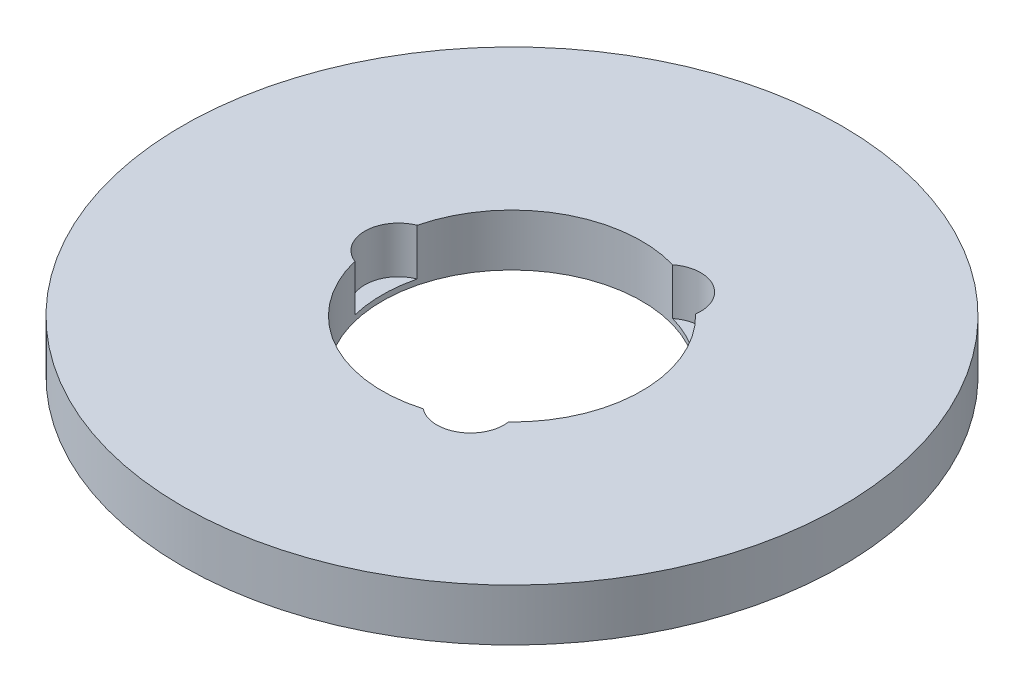
ISO-10303-21;
HEADER;
FILE_DESCRIPTION(('STEP AP214'),'2;1');
FILE_NAME('part.step','',(''),(''),'','','');
FILE_SCHEMA(('AUTOMOTIVE_DESIGN { 1 0 10303 214 1 1 1 1 }'));
ENDSEC;
DATA;
#1=APPLICATION_CONTEXT('core data for automotive mechanical design processes');
#2=APPLICATION_PROTOCOL_DEFINITION('international standard','automotive_design',2000,#1);
#3=PRODUCT_CONTEXT('',#1,'mechanical');
#4=PRODUCT('Part','Part','',(#3));
#5=PRODUCT_RELATED_PRODUCT_CATEGORY('part','',(#4));
#6=PRODUCT_DEFINITION_FORMATION('','',#4);
#7=PRODUCT_DEFINITION_CONTEXT('part definition',#1,'design');
#8=PRODUCT_DEFINITION('design','',#6,#7);
#9=PRODUCT_DEFINITION_SHAPE('','',#8);
#10=(LENGTH_UNIT() NAMED_UNIT(*) SI_UNIT(.MILLI.,.METRE.));
#11=(NAMED_UNIT(*) PLANE_ANGLE_UNIT() SI_UNIT($,.RADIAN.));
#12=(NAMED_UNIT(*) SI_UNIT($,.STERADIAN.) SOLID_ANGLE_UNIT());
#13=UNCERTAINTY_MEASURE_WITH_UNIT(LENGTH_MEASURE(1.E-05),#10,'distance_accuracy_value','');
#14=(GEOMETRIC_REPRESENTATION_CONTEXT(3) GLOBAL_UNCERTAINTY_ASSIGNED_CONTEXT((#13)) GLOBAL_UNIT_ASSIGNED_CONTEXT((#10,
#11,#12)) REPRESENTATION_CONTEXT('',''));
#15=CARTESIAN_POINT('',(0.,0.,0.));
#16=DIRECTION('',(0.,0.,1.));
#17=DIRECTION('',(1.,0.,0.));
#18=AXIS2_PLACEMENT_3D('',#15,#16,#17);
#19=CARTESIAN_POINT('',(0.,13.,0.));
#20=DIRECTION('',(0.,-1.,0.));
#21=DIRECTION('',(0.,0.,-1.));
#22=AXIS2_PLACEMENT_3D('',#19,#20,#21);
#23=CYLINDRICAL_SURFACE('',#22,82.5);
#24=CARTESIAN_POINT('',(0.,13.,0.));
#25=DIRECTION('',(0.,1.,0.));
#26=DIRECTION('',(0.,0.,1.));
#27=AXIS2_PLACEMENT_3D('',#24,#25,#26);
#28=CIRCLE('',#27,82.5);
#29=CARTESIAN_POINT('',(0.,13.,-82.5));
#30=VERTEX_POINT('',#29);
#31=EDGE_CURVE('E130',#30,#30,#28,.T.);
#32=CARTESIAN_POINT('',(0.,0.,0.));
#33=DIRECTION('',(0.,1.,0.));
#34=DIRECTION('',(0.,0.,1.));
#35=AXIS2_PLACEMENT_3D('',#32,#33,#34);
#36=CIRCLE('',#35,82.5);
#37=CARTESIAN_POINT('',(0.,0.,-82.5));
#38=VERTEX_POINT('',#37);
#39=EDGE_CURVE('E117',#38,#38,#36,.T.);
#40=CARTESIAN_POINT('',(0.,13.,-82.5));
#41=CARTESIAN_POINT('',(0.,12.8645833333333,-82.5));
#42=CARTESIAN_POINT('',(0.,12.7291666666667,-82.5));
#43=CARTESIAN_POINT('',(0.,12.4583333333333,-82.5));
#44=CARTESIAN_POINT('',(0.,12.3229166666667,-82.5));
#45=CARTESIAN_POINT('',(0.,12.0520833333333,-82.5));
#46=CARTESIAN_POINT('',(0.,11.9166666666667,-82.5));
#47=CARTESIAN_POINT('',(0.,11.6458333333333,-82.5));
#48=CARTESIAN_POINT('',(0.,11.5104166666667,-82.5));
#49=CARTESIAN_POINT('',(0.,11.2395833333333,-82.5));
#50=CARTESIAN_POINT('',(0.,11.1041666666667,-82.5));
#51=CARTESIAN_POINT('',(0.,10.8333333333333,-82.5));
#52=CARTESIAN_POINT('',(0.,10.6979166666667,-82.5));
#53=CARTESIAN_POINT('',(0.,10.4270833333333,-82.5));
#54=CARTESIAN_POINT('',(0.,10.2916666666667,-82.5));
#55=CARTESIAN_POINT('',(0.,10.0208333333333,-82.5));
#56=CARTESIAN_POINT('',(0.,9.88541666666667,-82.5));
#57=CARTESIAN_POINT('',(0.,9.61458333333333,-82.5));
#58=CARTESIAN_POINT('',(0.,9.47916666666667,-82.5));
#59=CARTESIAN_POINT('',(0.,9.20833333333333,-82.5));
#60=CARTESIAN_POINT('',(0.,9.07291666666667,-82.5));
#61=CARTESIAN_POINT('',(0.,8.80208333333333,-82.5));
#62=CARTESIAN_POINT('',(0.,8.66666666666667,-82.5));
#63=CARTESIAN_POINT('',(0.,8.39583333333333,-82.5));
#64=CARTESIAN_POINT('',(0.,8.26041666666667,-82.5));
#65=CARTESIAN_POINT('',(0.,7.98958333333333,-82.5));
#66=CARTESIAN_POINT('',(0.,7.85416666666667,-82.5));
#67=CARTESIAN_POINT('',(0.,7.58333333333333,-82.5));
#68=CARTESIAN_POINT('',(0.,7.44791666666667,-82.5));
#69=CARTESIAN_POINT('',(0.,7.17708333333333,-82.5));
#70=CARTESIAN_POINT('',(0.,7.04166666666667,-82.5));
#71=CARTESIAN_POINT('',(0.,6.77083333333333,-82.5));
#72=CARTESIAN_POINT('',(0.,6.63541666666667,-82.5));
#73=CARTESIAN_POINT('',(0.,6.36458333333333,-82.5));
#74=CARTESIAN_POINT('',(0.,6.22916666666667,-82.5));
#75=CARTESIAN_POINT('',(0.,5.95833333333333,-82.5));
#76=CARTESIAN_POINT('',(0.,5.82291666666667,-82.5));
#77=CARTESIAN_POINT('',(0.,5.55208333333333,-82.5));
#78=CARTESIAN_POINT('',(0.,5.41666666666667,-82.5));
#79=CARTESIAN_POINT('',(0.,5.14583333333333,-82.5));
#80=CARTESIAN_POINT('',(0.,5.01041666666667,-82.5));
#81=CARTESIAN_POINT('',(0.,4.73958333333333,-82.5));
#82=CARTESIAN_POINT('',(0.,4.60416666666667,-82.5));
#83=CARTESIAN_POINT('',(0.,4.33333333333333,-82.5));
#84=CARTESIAN_POINT('',(0.,4.19791666666667,-82.5));
#85=CARTESIAN_POINT('',(0.,3.92708333333333,-82.5));
#86=CARTESIAN_POINT('',(0.,3.79166666666667,-82.5));
#87=CARTESIAN_POINT('',(0.,3.52083333333333,-82.5));
#88=CARTESIAN_POINT('',(0.,3.38541666666667,-82.5));
#89=CARTESIAN_POINT('',(0.,3.11458333333333,-82.5));
#90=CARTESIAN_POINT('',(0.,2.97916666666667,-82.5));
#91=CARTESIAN_POINT('',(0.,2.70833333333333,-82.5));
#92=CARTESIAN_POINT('',(0.,2.57291666666667,-82.5));
#93=CARTESIAN_POINT('',(0.,2.30208333333333,-82.5));
#94=CARTESIAN_POINT('',(0.,2.16666666666667,-82.5));
#95=CARTESIAN_POINT('',(0.,1.89583333333333,-82.5));
#96=CARTESIAN_POINT('',(0.,1.76041666666667,-82.5));
#97=CARTESIAN_POINT('',(0.,1.48958333333333,-82.5));
#98=CARTESIAN_POINT('',(0.,1.35416666666667,-82.5));
#99=CARTESIAN_POINT('',(0.,1.08333333333333,-82.5));
#100=CARTESIAN_POINT('',(0.,0.947916666666667,-82.5));
#101=CARTESIAN_POINT('',(0.,0.677083333333334,-82.5));
#102=CARTESIAN_POINT('',(0.,0.541666666666667,-82.5));
#103=CARTESIAN_POINT('',(0.,0.270833333333334,-82.5));
#104=CARTESIAN_POINT('',(0.,0.135416666666667,-82.5));
#105=CARTESIAN_POINT('',(0.,0.,-82.5));
#106=B_SPLINE_CURVE_WITH_KNOTS('',3,(#40,#41,#42,#43,#44,#45,#46,#47,#48,#49,#50,#51,#52,#53,
#54,#55,#56,#57,#58,#59,#60,#61,#62,#63,#64,#65,#66,#67,#68,#69,#70,#71,#72,#73,#74,#75,#76,#77,
#78,#79,#80,#81,#82,#83,#84,#85,#86,#87,#88,#89,#90,#91,#92,#93,#94,#95,#96,#97,#98,#99,#100,
#101,#102,#103,#104,#105),.UNSPECIFIED.,.F.,.F.,(4,2,2,2,2,2,2,2,2,2,2,2,2,2,2,2,2,2,2,2,2,2,2,
2,2,2,2,2,2,2,2,2,4),(0.,0.406249999999999,0.812499999999999,1.21875,1.625,2.03125,2.4375,
2.84375,3.25,3.65625,4.0625,4.46875,4.875,5.28125,5.6875,6.09375,6.5,6.90625,7.3125,7.71875,
8.125,8.53125,8.9375,9.34375,9.75,10.15625,10.5625,10.96875,11.375,11.78125,12.1875,12.59375,
13.),.UNSPECIFIED.);
#107=EDGE_CURVE('BSEAM39',#30,#38,#106,.T.);
#108=ORIENTED_EDGE('',*,*,#31,.F.);
#109=ORIENTED_EDGE('',*,*,#39,.T.);
#110=ORIENTED_EDGE('',*,*,#107,.T.);
#111=ORIENTED_EDGE('',*,*,#107,.F.);
#112=EDGE_LOOP('',(#108,#110,#109,#111));
#113=FACE_BOUND('',#112,.T.);
#114=ADVANCED_FACE('F39',(#113),#23,.T.);
#115=CARTESIAN_POINT('',(0.,13.,0.));
#116=DIRECTION('',(0.,1.,0.));
#117=DIRECTION('',(0.,0.,1.));
#118=AXIS2_PLACEMENT_3D('',#115,#116,#117);
#119=PLANE('',#118);
#120=CARTESIAN_POINT('',(14.2132326895072,13.,24.618041158025));
#121=DIRECTION('',(0.,1.,0.));
#122=DIRECTION('',(0.866025403784436,0.,-0.500000000000004));
#123=AXIS2_PLACEMENT_3D('',#120,#121,#122);
#124=CIRCLE('',#123,8.4118358545254);
#125=CARTESIAN_POINT('',(9.0086788623039,13.,31.226490439303));
#126=VERTEX_POINT('',#125);
#127=CARTESIAN_POINT('',(22.5385945603165,13.,23.4149899689423));
#128=VERTEX_POINT('',#127);
#129=EDGE_CURVE('E148',#126,#128,#124,.T.);
#130=ORIENTED_EDGE('',*,*,#129,.F.);
#131=CARTESIAN_POINT('',(0.,13.,0.));
#132=DIRECTION('',(0.,1.,0.));
#133=DIRECTION('',(0.,0.,1.));
#134=AXIS2_PLACEMENT_3D('',#131,#132,#133);
#135=CIRCLE('',#134,32.5);
#136=CARTESIAN_POINT('',(-31.5472734226202,13.,7.81150047036054));
#137=VERTEX_POINT('',#136);
#138=EDGE_CURVE('E113',#137,#126,#135,.T.);
#139=ORIENTED_EDGE('',*,*,#138,.F.);
#140=CARTESIAN_POINT('',(-28.4264653790142,13.,0.));
#141=DIRECTION('',(0.,1.,0.));
#142=DIRECTION('',(0.,0.,1.));
#143=AXIS2_PLACEMENT_3D('',#140,#141,#142);
#144=CIRCLE('',#143,8.4118358545254);
#145=CARTESIAN_POINT('',(-31.5472734226202,13.,-7.81150047036054));
#146=VERTEX_POINT('',#145);
#147=EDGE_CURVE('E125',#146,#137,#144,.T.);
#148=ORIENTED_EDGE('',*,*,#147,.F.);
#149=CARTESIAN_POINT('',(9.00867886230347,13.,-31.2264904393031));
#150=VERTEX_POINT('',#149);
#151=EDGE_CURVE('E107',#150,#146,#135,.T.);
#152=ORIENTED_EDGE('',*,*,#151,.F.);
#153=CARTESIAN_POINT('',(14.2132326895069,13.,-24.6180411580252));
#154=DIRECTION('',(0.,1.,0.));
#155=DIRECTION('',(-0.866025403784443,0.,-0.499999999999992));
#156=AXIS2_PLACEMENT_3D('',#153,#154,#155);
#157=CIRCLE('',#156,8.4118358545254);
#158=CARTESIAN_POINT('',(22.5385945603162,13.,-23.4149899689427));
#159=VERTEX_POINT('',#158);
#160=EDGE_CURVE('E95',#159,#150,#157,.T.);
#161=ORIENTED_EDGE('',*,*,#160,.F.);
#162=EDGE_CURVE('E106',#128,#159,#135,.T.);
#163=ORIENTED_EDGE('',*,*,#162,.F.);
#164=EDGE_LOOP('',(#130,#139,#148,#152,#161,#163));
#165=FACE_BOUND('',#164,.T.);
#166=ORIENTED_EDGE('',*,*,#31,.T.);
#167=EDGE_LOOP('',(#166));
#168=FACE_BOUND('',#167,.T.);
#169=ADVANCED_FACE('F102',(#165,#168),#119,.T.);
#170=CARTESIAN_POINT('',(0.,0.,0.));
#171=DIRECTION('',(0.,1.,0.));
#172=DIRECTION('',(0.,0.,1.));
#173=AXIS2_PLACEMENT_3D('',#170,#171,#172);
#174=PLANE('',#173);
#175=CARTESIAN_POINT('',(0.,0.,0.));
#176=DIRECTION('',(0.,1.,0.));
#177=DIRECTION('',(0.,0.,1.));
#178=AXIS2_PLACEMENT_3D('',#175,#176,#177);
#179=CIRCLE('',#178,32.5);
#180=CARTESIAN_POINT('',(0.,0.,32.5));
#181=VERTEX_POINT('',#180);
#182=EDGE_CURVE('E118',#181,#181,#179,.T.);
#183=ORIENTED_EDGE('',*,*,#182,.T.);
#184=EDGE_LOOP('',(#183));
#185=FACE_BOUND('',#184,.T.);
#186=ORIENTED_EDGE('',*,*,#39,.F.);
#187=EDGE_LOOP('',(#186));
#188=FACE_BOUND('',#187,.T.);
#189=ADVANCED_FACE('F161',(#185,#188),#174,.F.);
#190=CARTESIAN_POINT('',(0.,13.,0.));
#191=DIRECTION('',(0.,-1.,0.));
#192=DIRECTION('',(0.,0.,-1.));
#193=AXIS2_PLACEMENT_3D('',#190,#191,#192);
#194=CYLINDRICAL_SURFACE('',#193,32.5);
#195=DIRECTION('',(0.,1.,0.));
#196=VECTOR('',#195,1.);
#197=CARTESIAN_POINT('',(9.00867886230391,7.17411844117256,31.226490439303));
#198=LINE('',#197,#196);
#199=CARTESIAN_POINT('',(9.0086788623039,1.34823688234512,31.226490439303));
#200=VERTEX_POINT('',#199);
#201=EDGE_CURVE('E11',#200,#126,#198,.T.);
#202=ORIENTED_EDGE('',*,*,#201,.F.);
#203=CARTESIAN_POINT('',(0.,1.34823688234512,0.));
#204=DIRECTION('',(0.,1.,0.));
#205=DIRECTION('',(0.,0.,1.));
#206=AXIS2_PLACEMENT_3D('',#203,#204,#205);
#207=CIRCLE('',#206,32.5);
#208=CARTESIAN_POINT('',(22.5385945603165,1.34823688234512,23.4149899689423));
#209=VERTEX_POINT('',#208);
#210=EDGE_CURVE('E100',#200,#209,#207,.T.);
#211=ORIENTED_EDGE('',*,*,#210,.T.);
#212=DIRECTION('',(0.,1.,0.));
#213=VECTOR('',#212,1.);
#214=CARTESIAN_POINT('',(22.5385945603165,7.17411844117256,23.4149899689424));
#215=LINE('',#214,#213);
#216=EDGE_CURVE('E46',#128,#209,#215,.F.);
#217=ORIENTED_EDGE('',*,*,#216,.F.);
#218=ORIENTED_EDGE('',*,*,#162,.T.);
#219=DIRECTION('',(0.,1.,0.));
#220=VECTOR('',#219,1.);
#221=CARTESIAN_POINT('',(22.5385945603162,7.17411844117256,-23.4149899689427));
#222=LINE('',#221,#220);
#223=CARTESIAN_POINT('',(22.5385945603162,1.34823688234512,-23.4149899689427));
#224=VERTEX_POINT('',#223);
#225=EDGE_CURVE('E90',#224,#159,#222,.T.);
#226=ORIENTED_EDGE('',*,*,#225,.F.);
#227=CARTESIAN_POINT('',(0.,1.34823688234512,0.));
#228=DIRECTION('',(0.,1.,0.));
#229=DIRECTION('',(0.,0.,1.));
#230=AXIS2_PLACEMENT_3D('',#227,#228,#229);
#231=CIRCLE('',#230,32.5);
#232=CARTESIAN_POINT('',(9.00867886230347,1.34823688234512,-31.2264904393031));
#233=VERTEX_POINT('',#232);
#234=EDGE_CURVE('E143',#224,#233,#231,.T.);
#235=ORIENTED_EDGE('',*,*,#234,.T.);
#236=DIRECTION('',(0.,1.,0.));
#237=VECTOR('',#236,1.);
#238=CARTESIAN_POINT('',(9.00867886230348,7.17411844117256,-31.2264904393031));
#239=LINE('',#238,#237);
#240=EDGE_CURVE('E98',#150,#233,#239,.F.);
#241=ORIENTED_EDGE('',*,*,#240,.F.);
#242=ORIENTED_EDGE('',*,*,#151,.T.);
#243=DIRECTION('',(0.,1.,0.));
#244=VECTOR('',#243,1.);
#245=CARTESIAN_POINT('',(-31.5472734226202,7.17411844117256,-7.81150047036054));
#246=LINE('',#245,#244);
#247=CARTESIAN_POINT('',(-31.5472734226202,1.34823688234512,-7.81150047036054));
#248=VERTEX_POINT('',#247);
#249=EDGE_CURVE('E137',#248,#146,#246,.T.);
#250=ORIENTED_EDGE('',*,*,#249,.F.);
#251=CARTESIAN_POINT('',(0.,1.34823688234512,0.));
#252=DIRECTION('',(0.,1.,0.));
#253=DIRECTION('',(0.,0.,1.));
#254=AXIS2_PLACEMENT_3D('',#251,#252,#253);
#255=CIRCLE('',#254,32.5);
#256=CARTESIAN_POINT('',(-31.5472734226202,1.34823688234512,7.81150047036054));
#257=VERTEX_POINT('',#256);
#258=EDGE_CURVE('E128',#248,#257,#255,.T.);
#259=ORIENTED_EDGE('',*,*,#258,.T.);
#260=DIRECTION('',(0.,1.,0.));
#261=VECTOR('',#260,1.);
#262=CARTESIAN_POINT('',(-31.5472734226202,7.17411844117256,7.81150047036054));
#263=LINE('',#262,#261);
#264=EDGE_CURVE('E134',#137,#257,#263,.F.);
#265=ORIENTED_EDGE('',*,*,#264,.F.);
#266=ORIENTED_EDGE('',*,*,#138,.T.);
#267=EDGE_LOOP('',(#202,#211,#217,#218,#226,#235,#241,#242,#250,#259,#265,#266));
#268=FACE_BOUND('',#267,.T.);
#269=ORIENTED_EDGE('',*,*,#182,.F.);
#270=EDGE_LOOP('',(#269));
#271=FACE_BOUND('',#270,.T.);
#272=ADVANCED_FACE('F115',(#268,#271),#194,.F.);
#273=CARTESIAN_POINT('',(-28.4264653790142,1.34823688234512,0.));
#274=DIRECTION('',(0.,1.,0.));
#275=DIRECTION('',(0.,0.,1.));
#276=AXIS2_PLACEMENT_3D('',#273,#274,#275);
#277=CYLINDRICAL_SURFACE('',#276,8.4118358545254);
#278=ORIENTED_EDGE('',*,*,#249,.T.);
#279=ORIENTED_EDGE('',*,*,#147,.T.);
#280=ORIENTED_EDGE('',*,*,#264,.T.);
#281=CARTESIAN_POINT('',(-28.4264653790142,1.34823688234512,0.));
#282=DIRECTION('',(0.,1.,0.));
#283=DIRECTION('',(0.,0.,1.));
#284=AXIS2_PLACEMENT_3D('',#281,#282,#283);
#285=CIRCLE('',#284,8.4118358545254);
#286=EDGE_CURVE('E127',#248,#257,#285,.T.);
#287=ORIENTED_EDGE('',*,*,#286,.F.);
#288=EDGE_LOOP('',(#278,#279,#280,#287));
#289=FACE_BOUND('',#288,.T.);
#290=ADVANCED_FACE('F175',(#289),#277,.F.);
#291=CARTESIAN_POINT('',(-28.4264653790142,1.34823688234512,0.));
#292=DIRECTION('',(0.,1.,0.));
#293=DIRECTION('',(0.,0.,1.));
#294=AXIS2_PLACEMENT_3D('',#291,#292,#293);
#295=PLANE('',#294);
#296=ORIENTED_EDGE('',*,*,#286,.T.);
#297=ORIENTED_EDGE('',*,*,#258,.F.);
#298=EDGE_LOOP('',(#296,#297));
#299=FACE_BOUND('',#298,.T.);
#300=ADVANCED_FACE('F176',(#299),#295,.T.);
#301=CARTESIAN_POINT('',(14.2132326895069,1.34823688234512,-24.6180411580252));
#302=DIRECTION('',(0.,1.,0.));
#303=DIRECTION('',(0.,0.,1.));
#304=AXIS2_PLACEMENT_3D('',#301,#302,#303);
#305=CYLINDRICAL_SURFACE('',#304,8.4118358545254);
#306=ORIENTED_EDGE('',*,*,#225,.T.);
#307=ORIENTED_EDGE('',*,*,#160,.T.);
#308=ORIENTED_EDGE('',*,*,#240,.T.);
#309=CARTESIAN_POINT('',(14.2132326895069,1.34823688234512,-24.6180411580252));
#310=DIRECTION('',(0.,1.,0.));
#311=DIRECTION('',(-0.866025403784443,0.,-0.499999999999992));
#312=AXIS2_PLACEMENT_3D('',#309,#310,#311);
#313=CIRCLE('',#312,8.4118358545254);
#314=EDGE_CURVE('E56',#224,#233,#313,.T.);
#315=ORIENTED_EDGE('',*,*,#314,.F.);
#316=EDGE_LOOP('',(#306,#307,#308,#315));
#317=FACE_BOUND('',#316,.T.);
#318=ADVANCED_FACE('F93',(#317),#305,.F.);
#319=CARTESIAN_POINT('',(14.2132326895069,1.34823688234512,-24.6180411580252));
#320=DIRECTION('',(0.,1.,0.));
#321=DIRECTION('',(-0.866025403784443,0.,-0.499999999999992));
#322=AXIS2_PLACEMENT_3D('',#319,#320,#321);
#323=PLANE('',#322);
#324=ORIENTED_EDGE('',*,*,#314,.T.);
#325=ORIENTED_EDGE('',*,*,#234,.F.);
#326=EDGE_LOOP('',(#324,#325));
#327=FACE_BOUND('',#326,.T.);
#328=ADVANCED_FACE('F153',(#327),#323,.T.);
#329=CARTESIAN_POINT('',(14.2132326895072,1.34823688234512,24.618041158025));
#330=DIRECTION('',(0.,1.,0.));
#331=DIRECTION('',(0.,0.,1.));
#332=AXIS2_PLACEMENT_3D('',#329,#330,#331);
#333=CYLINDRICAL_SURFACE('',#332,8.4118358545254);
#334=ORIENTED_EDGE('',*,*,#201,.T.);
#335=ORIENTED_EDGE('',*,*,#129,.T.);
#336=ORIENTED_EDGE('',*,*,#216,.T.);
#337=CARTESIAN_POINT('',(14.2132326895072,1.34823688234512,24.618041158025));
#338=DIRECTION('',(0.,1.,0.));
#339=DIRECTION('',(0.866025403784436,0.,-0.500000000000004));
#340=AXIS2_PLACEMENT_3D('',#337,#338,#339);
#341=CIRCLE('',#340,8.4118358545254);
#342=EDGE_CURVE('E55',#200,#209,#341,.T.);
#343=ORIENTED_EDGE('',*,*,#342,.F.);
#344=EDGE_LOOP('',(#334,#335,#336,#343));
#345=FACE_BOUND('',#344,.T.);
#346=ADVANCED_FACE('F144',(#345),#333,.F.);
#347=CARTESIAN_POINT('',(14.2132326895072,1.34823688234512,24.618041158025));
#348=DIRECTION('',(0.,1.,0.));
#349=DIRECTION('',(0.866025403784436,0.,-0.500000000000004));
#350=AXIS2_PLACEMENT_3D('',#347,#348,#349);
#351=PLANE('',#350);
#352=ORIENTED_EDGE('',*,*,#342,.T.);
#353=ORIENTED_EDGE('',*,*,#210,.F.);
#354=EDGE_LOOP('',(#352,#353));
#355=FACE_BOUND('',#354,.T.);
#356=ADVANCED_FACE('F150',(#355),#351,.T.);
#357=CLOSED_SHELL('',(#114,#169,#189,#272,#290,#300,#318,#328,#346,#356));
#358=MANIFOLD_SOLID_BREP('B2',#357);
#359=ADVANCED_BREP_SHAPE_REPRESENTATION('',(#18,#358),#14);
#360=SHAPE_DEFINITION_REPRESENTATION(#9,#359);
ENDSEC;
END-ISO-10303-21;
